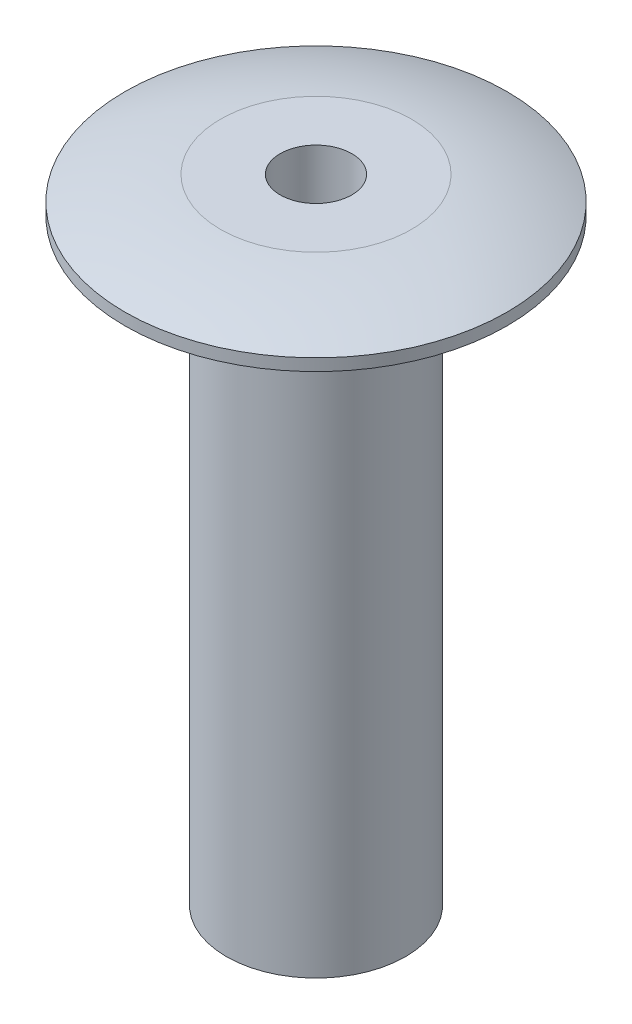
ISO-10303-21;
HEADER;
FILE_DESCRIPTION(('STEP AP214'),'2;1');
FILE_NAME('part.step','',(''),(''),'','','');
FILE_SCHEMA(('AUTOMOTIVE_DESIGN { 1 0 10303 214 1 1 1 1 }'));
ENDSEC;
DATA;
#1=APPLICATION_CONTEXT('core data for automotive mechanical design processes');
#2=APPLICATION_PROTOCOL_DEFINITION('international standard','automotive_design',2000,#1);
#3=PRODUCT_CONTEXT('',#1,'mechanical');
#4=PRODUCT('Part','Part','',(#3));
#5=PRODUCT_RELATED_PRODUCT_CATEGORY('part','',(#4));
#6=PRODUCT_DEFINITION_FORMATION('','',#4);
#7=PRODUCT_DEFINITION_CONTEXT('part definition',#1,'design');
#8=PRODUCT_DEFINITION('design','',#6,#7);
#9=PRODUCT_DEFINITION_SHAPE('','',#8);
#10=(LENGTH_UNIT() NAMED_UNIT(*) SI_UNIT(.MILLI.,.METRE.));
#11=(NAMED_UNIT(*) PLANE_ANGLE_UNIT() SI_UNIT($,.RADIAN.));
#12=(NAMED_UNIT(*) SI_UNIT($,.STERADIAN.) SOLID_ANGLE_UNIT());
#13=UNCERTAINTY_MEASURE_WITH_UNIT(LENGTH_MEASURE(1.E-05),#10,'distance_accuracy_value','');
#14=(GEOMETRIC_REPRESENTATION_CONTEXT(3) GLOBAL_UNCERTAINTY_ASSIGNED_CONTEXT((#13)) GLOBAL_UNIT_ASSIGNED_CONTEXT((#10,
#11,#12)) REPRESENTATION_CONTEXT('',''));
#15=CARTESIAN_POINT('',(0.,0.,0.));
#16=DIRECTION('',(0.,0.,1.));
#17=DIRECTION('',(1.,0.,0.));
#18=AXIS2_PLACEMENT_3D('',#15,#16,#17);
#19=CARTESIAN_POINT('',(0.,0.,0.));
#20=DIRECTION('',(0.,-1.,0.));
#21=DIRECTION('',(0.,0.,-1.));
#22=AXIS2_PLACEMENT_3D('',#19,#20,#21);
#23=CYLINDRICAL_SURFACE('',#22,1.5);
#24=CARTESIAN_POINT('',(0.,10.,0.));
#25=DIRECTION('',(0.,-1.,0.));
#26=DIRECTION('',(0.,0.,-1.));
#27=AXIS2_PLACEMENT_3D('',#24,#25,#26);
#28=CIRCLE('',#27,1.5);
#29=CARTESIAN_POINT('',(0.,10.,-1.5));
#30=VERTEX_POINT('',#29);
#31=EDGE_CURVE('E10',#30,#30,#28,.T.);
#32=ORIENTED_EDGE('',*,*,#31,.T.);
#33=EDGE_LOOP('',(#32));
#34=FACE_BOUND('',#33,.T.);
#35=CARTESIAN_POINT('',(0.,0.,0.));
#36=DIRECTION('',(0.,-1.,0.));
#37=DIRECTION('',(0.,0.,-1.));
#38=AXIS2_PLACEMENT_3D('',#35,#36,#37);
#39=CIRCLE('',#38,1.5);
#40=CARTESIAN_POINT('',(0.,0.,-1.5));
#41=VERTEX_POINT('',#40);
#42=EDGE_CURVE('E55',#41,#41,#39,.T.);
#43=ORIENTED_EDGE('',*,*,#42,.F.);
#44=EDGE_LOOP('',(#43));
#45=FACE_BOUND('',#44,.T.);
#46=ADVANCED_FACE('F30',(#34,#45),#23,.T.);
#47=CARTESIAN_POINT('',(1.5,10.,0.));
#48=DIRECTION('',(0.,-1.,0.));
#49=DIRECTION('',(0.,0.,-1.));
#50=AXIS2_PLACEMENT_3D('',#47,#48,#49);
#51=PLANE('',#50);
#52=CARTESIAN_POINT('',(0.,10.,0.));
#53=DIRECTION('',(0.,-1.,0.));
#54=DIRECTION('',(0.,0.,-1.));
#55=AXIS2_PLACEMENT_3D('',#52,#53,#54);
#56=CIRCLE('',#55,3.2);
#57=CARTESIAN_POINT('',(0.,10.,-3.2));
#58=VERTEX_POINT('',#57);
#59=EDGE_CURVE('E36',#58,#58,#56,.T.);
#60=ORIENTED_EDGE('',*,*,#59,.T.);
#61=EDGE_LOOP('',(#60));
#62=FACE_BOUND('',#61,.T.);
#63=ORIENTED_EDGE('',*,*,#31,.F.);
#64=EDGE_LOOP('',(#63));
#65=FACE_BOUND('',#64,.T.);
#66=ADVANCED_FACE('F63',(#62,#65),#51,.T.);
#67=CARTESIAN_POINT('',(0.,0.,0.));
#68=DIRECTION('',(0.,-1.,0.));
#69=DIRECTION('',(0.,0.,-1.));
#70=AXIS2_PLACEMENT_3D('',#67,#68,#69);
#71=CYLINDRICAL_SURFACE('',#70,3.2);
#72=CARTESIAN_POINT('',(0.,10.2,0.));
#73=DIRECTION('',(0.,-1.,0.));
#74=DIRECTION('',(0.,0.,-1.));
#75=AXIS2_PLACEMENT_3D('',#72,#73,#74);
#76=CIRCLE('',#75,3.2);
#77=CARTESIAN_POINT('',(0.,10.2,-3.2));
#78=VERTEX_POINT('',#77);
#79=EDGE_CURVE('E40',#78,#78,#76,.T.);
#80=ORIENTED_EDGE('',*,*,#79,.T.);
#81=EDGE_LOOP('',(#80));
#82=FACE_BOUND('',#81,.T.);
#83=ORIENTED_EDGE('',*,*,#59,.F.);
#84=EDGE_LOOP('',(#83));
#85=FACE_BOUND('',#84,.T.);
#86=ADVANCED_FACE('F67',(#82,#85),#71,.T.);
#87=CARTESIAN_POINT('',(0.,5.29606520271613,0.));
#88=DIRECTION('',(0.,-1.,0.));
#89=DIRECTION('',(0.,0.,-1.));
#90=AXIS2_PLACEMENT_3D('',#87,#88,#89);
#91=DEGENERATE_TOROIDAL_SURFACE('',#90,1.12401630067903,5.32524974211144,.T.);
#92=CARTESIAN_POINT('',(0.,10.6,0.));
#93=DIRECTION('',(0.,-1.,0.));
#94=DIRECTION('',(0.,0.,-1.));
#95=AXIS2_PLACEMENT_3D('',#92,#93,#94);
#96=CIRCLE('',#95,1.6);
#97=CARTESIAN_POINT('',(0.,10.6,-1.6));
#98=VERTEX_POINT('',#97);
#99=EDGE_CURVE('E44',#98,#98,#96,.T.);
#100=ORIENTED_EDGE('',*,*,#99,.T.);
#101=EDGE_LOOP('',(#100));
#102=FACE_BOUND('',#101,.T.);
#103=ORIENTED_EDGE('',*,*,#79,.F.);
#104=EDGE_LOOP('',(#103));
#105=FACE_BOUND('',#104,.T.);
#106=ADVANCED_FACE('F71',(#102,#105),#91,.T.);
#107=CARTESIAN_POINT('',(0.6,10.6,0.));
#108=DIRECTION('',(0.,1.,0.));
#109=DIRECTION('',(0.,0.,1.));
#110=AXIS2_PLACEMENT_3D('',#107,#108,#109);
#111=PLANE('',#110);
#112=CARTESIAN_POINT('',(0.,10.6,0.));
#113=DIRECTION('',(0.,-1.,0.));
#114=DIRECTION('',(0.,0.,-1.));
#115=AXIS2_PLACEMENT_3D('',#112,#113,#114);
#116=CIRCLE('',#115,0.6);
#117=CARTESIAN_POINT('',(0.,10.6,-0.6));
#118=VERTEX_POINT('',#117);
#119=EDGE_CURVE('E49',#118,#118,#116,.T.);
#120=ORIENTED_EDGE('',*,*,#119,.T.);
#121=EDGE_LOOP('',(#120));
#122=FACE_BOUND('',#121,.T.);
#123=ORIENTED_EDGE('',*,*,#99,.F.);
#124=EDGE_LOOP('',(#123));
#125=FACE_BOUND('',#124,.T.);
#126=ADVANCED_FACE('F78',(#122,#125),#111,.T.);
#127=CARTESIAN_POINT('',(0.,0.,0.));
#128=DIRECTION('',(0.,-1.,0.));
#129=DIRECTION('',(0.,0.,-1.));
#130=AXIS2_PLACEMENT_3D('',#127,#128,#129);
#131=CYLINDRICAL_SURFACE('',#130,0.600000000000001);
#132=CARTESIAN_POINT('',(0.,0.,0.));
#133=DIRECTION('',(0.,-1.,0.));
#134=DIRECTION('',(0.,0.,-1.));
#135=AXIS2_PLACEMENT_3D('',#132,#133,#134);
#136=CIRCLE('',#135,0.600000000000001);
#137=CARTESIAN_POINT('',(0.,0.,-0.600000000000001));
#138=VERTEX_POINT('',#137);
#139=EDGE_CURVE('E52',#138,#138,#136,.T.);
#140=ORIENTED_EDGE('',*,*,#139,.T.);
#141=EDGE_LOOP('',(#140));
#142=FACE_BOUND('',#141,.T.);
#143=ORIENTED_EDGE('',*,*,#119,.F.);
#144=EDGE_LOOP('',(#143));
#145=FACE_BOUND('',#144,.T.);
#146=ADVANCED_FACE('F82',(#142,#145),#131,.F.);
#147=CARTESIAN_POINT('',(0.600000000000001,0.,0.));
#148=DIRECTION('',(0.,-1.,0.));
#149=DIRECTION('',(0.,0.,-1.));
#150=AXIS2_PLACEMENT_3D('',#147,#148,#149);
#151=PLANE('',#150);
#152=ORIENTED_EDGE('',*,*,#42,.T.);
#153=EDGE_LOOP('',(#152));
#154=FACE_BOUND('',#153,.T.);
#155=ORIENTED_EDGE('',*,*,#139,.F.);
#156=EDGE_LOOP('',(#155));
#157=FACE_BOUND('',#156,.T.);
#158=ADVANCED_FACE('F59',(#154,#157),#151,.T.);
#159=CLOSED_SHELL('',(#46,#66,#86,#106,#126,#146,#158));
#160=MANIFOLD_SOLID_BREP('B2',#159);
#161=ADVANCED_BREP_SHAPE_REPRESENTATION('',(#18,#160),#14);
#162=SHAPE_DEFINITION_REPRESENTATION(#9,#161);
ENDSEC;
END-ISO-10303-21;
